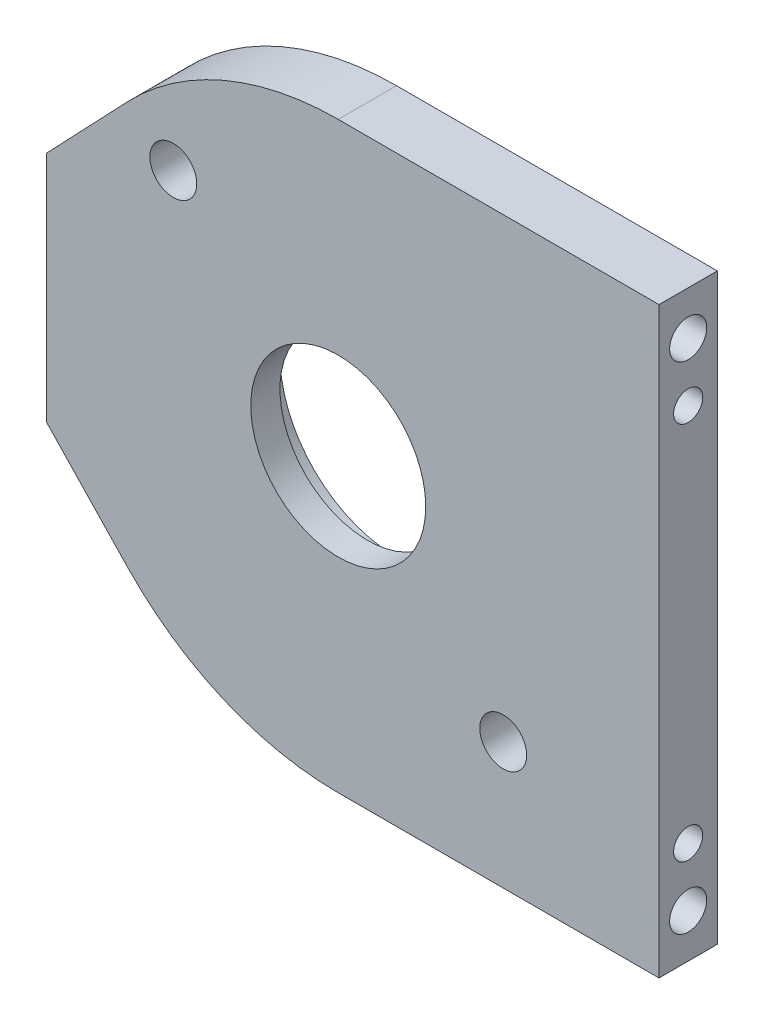
ISO-10303-21;
HEADER;
FILE_DESCRIPTION(('STEP AP214'),'2;1');
FILE_NAME('part.step','',(''),(''),'','','');
FILE_SCHEMA(('AUTOMOTIVE_DESIGN { 1 0 10303 214 1 1 1 1 }'));
ENDSEC;
DATA;
#1=APPLICATION_CONTEXT('core data for automotive mechanical design processes');
#2=APPLICATION_PROTOCOL_DEFINITION('international standard','automotive_design',2000,#1);
#3=PRODUCT_CONTEXT('',#1,'mechanical');
#4=PRODUCT('Part','Part','',(#3));
#5=PRODUCT_RELATED_PRODUCT_CATEGORY('part','',(#4));
#6=PRODUCT_DEFINITION_FORMATION('','',#4);
#7=PRODUCT_DEFINITION_CONTEXT('part definition',#1,'design');
#8=PRODUCT_DEFINITION('design','',#6,#7);
#9=PRODUCT_DEFINITION_SHAPE('','',#8);
#10=(LENGTH_UNIT() NAMED_UNIT(*) SI_UNIT(.MILLI.,.METRE.));
#11=(NAMED_UNIT(*) PLANE_ANGLE_UNIT() SI_UNIT($,.RADIAN.));
#12=(NAMED_UNIT(*) SI_UNIT($,.STERADIAN.) SOLID_ANGLE_UNIT());
#13=UNCERTAINTY_MEASURE_WITH_UNIT(LENGTH_MEASURE(1.E-05),#10,'distance_accuracy_value','');
#14=(GEOMETRIC_REPRESENTATION_CONTEXT(3) GLOBAL_UNCERTAINTY_ASSIGNED_CONTEXT((#13)) GLOBAL_UNIT_ASSIGNED_CONTEXT((#10,
#11,#12)) REPRESENTATION_CONTEXT('',''));
#15=CARTESIAN_POINT('',(0.,0.,0.));
#16=DIRECTION('',(0.,0.,1.));
#17=DIRECTION('',(1.,0.,0.));
#18=AXIS2_PLACEMENT_3D('',#15,#16,#17);
#19=CARTESIAN_POINT('',(0.,0.,6.35));
#20=DIRECTION('',(0.,0.,1.));
#21=DIRECTION('',(1.,0.,0.));
#22=AXIS2_PLACEMENT_3D('',#19,#20,#21);
#23=PLANE('',#22);
#24=CARTESIAN_POINT('',(-17.9605122421383,17.9605122421383,6.35));
#25=DIRECTION('',(0.,0.,1.));
#26=DIRECTION('',(1.,0.,0.));
#27=AXIS2_PLACEMENT_3D('',#24,#25,#26);
#28=CIRCLE('',#27,2.55269999999999);
#29=CARTESIAN_POINT('',(-15.4078122421383,17.9605122421383,6.35));
#30=VERTEX_POINT('',#29);
#31=EDGE_CURVE('E198',#30,#30,#28,.T.);
#32=ORIENTED_EDGE('',*,*,#31,.F.);
#33=EDGE_LOOP('',(#32));
#34=FACE_BOUND('',#33,.T.);
#35=CARTESIAN_POINT('',(17.9605122421383,-17.9605122421383,6.35));
#36=DIRECTION('',(0.,0.,1.));
#37=DIRECTION('',(1.,0.,0.));
#38=AXIS2_PLACEMENT_3D('',#35,#36,#37);
#39=CIRCLE('',#38,2.55269999999999);
#40=CARTESIAN_POINT('',(20.5132122421383,-17.9605122421383,6.35));
#41=VERTEX_POINT('',#40);
#42=EDGE_CURVE('E192',#41,#41,#39,.T.);
#43=ORIENTED_EDGE('',*,*,#42,.F.);
#44=EDGE_LOOP('',(#43));
#45=FACE_BOUND('',#44,.T.);
#46=CARTESIAN_POINT('',(0.,0.,6.35));
#47=DIRECTION('',(0.,0.,1.));
#48=DIRECTION('',(1.,0.,0.));
#49=AXIS2_PLACEMENT_3D('',#46,#47,#48);
#50=CIRCLE('',#49,31.75);
#51=CARTESIAN_POINT('',(0.,31.75,6.35));
#52=VERTEX_POINT('',#51);
#53=CARTESIAN_POINT('',(-22.9913793103448,21.8965517241379,6.35));
#54=VERTEX_POINT('',#53);
#55=EDGE_CURVE('E153',#52,#54,#50,.T.);
#56=ORIENTED_EDGE('',*,*,#55,.T.);
#57=DIRECTION('',(-0.689655172413793,-0.724137931034483,0.));
#58=VECTOR('',#57,1.);
#59=CARTESIAN_POINT('',(-22.9913793103448,21.8965517241379,6.35));
#60=LINE('',#59,#58);
#61=CARTESIAN_POINT('',(-31.75,12.7,6.35));
#62=VERTEX_POINT('',#61);
#63=EDGE_CURVE('E99',#54,#62,#60,.T.);
#64=ORIENTED_EDGE('',*,*,#63,.T.);
#65=DIRECTION('',(0.,-1.,0.));
#66=VECTOR('',#65,1.);
#67=CARTESIAN_POINT('',(-31.75,12.7,6.35));
#68=LINE('',#67,#66);
#69=CARTESIAN_POINT('',(-31.75,-12.7,6.35));
#70=VERTEX_POINT('',#69);
#71=EDGE_CURVE('E169',#62,#70,#68,.T.);
#72=ORIENTED_EDGE('',*,*,#71,.T.);
#73=DIRECTION('',(0.689655172413794,-0.724137931034482,0.));
#74=VECTOR('',#73,1.);
#75=CARTESIAN_POINT('',(-22.9913793103448,-21.8965517241379,6.35));
#76=LINE('',#75,#74);
#77=CARTESIAN_POINT('',(-22.9913793103448,-21.8965517241379,6.35));
#78=VERTEX_POINT('',#77);
#79=EDGE_CURVE('E181',#70,#78,#76,.T.);
#80=ORIENTED_EDGE('',*,*,#79,.T.);
#81=CARTESIAN_POINT('',(0.,0.,6.35));
#82=DIRECTION('',(0.,0.,1.));
#83=DIRECTION('',(1.,0.,0.));
#84=AXIS2_PLACEMENT_3D('',#81,#82,#83);
#85=CIRCLE('',#84,31.75);
#86=CARTESIAN_POINT('',(0.,-31.75,6.35));
#87=VERTEX_POINT('',#86);
#88=EDGE_CURVE('E120',#78,#87,#85,.T.);
#89=ORIENTED_EDGE('',*,*,#88,.T.);
#90=DIRECTION('',(1.,0.,0.));
#91=VECTOR('',#90,1.);
#92=CARTESIAN_POINT('',(34.925,-31.75,6.35));
#93=LINE('',#92,#91);
#94=CARTESIAN_POINT('',(34.925,-31.75,6.35));
#95=VERTEX_POINT('',#94);
#96=EDGE_CURVE('E114',#87,#95,#93,.T.);
#97=ORIENTED_EDGE('',*,*,#96,.T.);
#98=DIRECTION('',(0.,1.,0.));
#99=VECTOR('',#98,1.);
#100=CARTESIAN_POINT('',(34.925,31.75,6.35));
#101=LINE('',#100,#99);
#102=CARTESIAN_POINT('',(34.925,31.75,6.35));
#103=VERTEX_POINT('',#102);
#104=EDGE_CURVE('E118',#95,#103,#101,.T.);
#105=ORIENTED_EDGE('',*,*,#104,.T.);
#106=DIRECTION('',(-1.,0.,0.));
#107=VECTOR('',#106,1.);
#108=CARTESIAN_POINT('',(34.925,31.75,6.35));
#109=LINE('',#108,#107);
#110=EDGE_CURVE('E55',#103,#52,#109,.T.);
#111=ORIENTED_EDGE('',*,*,#110,.T.);
#112=EDGE_LOOP('',(#56,#64,#72,#80,#89,#97,#105,#111));
#113=FACE_BOUND('',#112,.T.);
#114=CARTESIAN_POINT('',(0.,0.,6.35));
#115=DIRECTION('',(0.,0.,1.));
#116=DIRECTION('',(1.,0.,0.));
#117=AXIS2_PLACEMENT_3D('',#114,#115,#116);
#118=CIRCLE('',#117,9.525);
#119=CARTESIAN_POINT('',(9.525,0.,6.35));
#120=VERTEX_POINT('',#119);
#121=EDGE_CURVE('E142',#120,#120,#118,.T.);
#122=ORIENTED_EDGE('',*,*,#121,.F.);
#123=EDGE_LOOP('',(#122));
#124=FACE_BOUND('',#123,.T.);
#125=ADVANCED_FACE('F37',(#34,#45,#113,#124),#23,.T.);
#126=CARTESIAN_POINT('',(0.,0.,0.));
#127=DIRECTION('',(0.,0.,1.));
#128=DIRECTION('',(1.,0.,0.));
#129=AXIS2_PLACEMENT_3D('',#126,#127,#128);
#130=PLANE('',#129);
#131=CARTESIAN_POINT('',(0.,0.,0.));
#132=DIRECTION('',(0.,0.,1.));
#133=DIRECTION('',(1.,0.,0.));
#134=AXIS2_PLACEMENT_3D('',#131,#132,#133);
#135=CIRCLE('',#134,12.7);
#136=CARTESIAN_POINT('',(12.7,0.,0.));
#137=VERTEX_POINT('',#136);
#138=EDGE_CURVE('E213',#137,#137,#135,.T.);
#139=ORIENTED_EDGE('',*,*,#138,.T.);
#140=EDGE_LOOP('',(#139));
#141=FACE_BOUND('',#140,.T.);
#142=CARTESIAN_POINT('',(-17.9605122421383,17.9605122421383,0.));
#143=DIRECTION('',(0.,0.,1.));
#144=DIRECTION('',(1.,0.,0.));
#145=AXIS2_PLACEMENT_3D('',#142,#143,#144);
#146=CIRCLE('',#145,2.5527);
#147=CARTESIAN_POINT('',(-15.4078122421383,17.9605122421383,0.));
#148=VERTEX_POINT('',#147);
#149=EDGE_CURVE('E195',#148,#148,#146,.T.);
#150=ORIENTED_EDGE('',*,*,#149,.T.);
#151=EDGE_LOOP('',(#150));
#152=FACE_BOUND('',#151,.T.);
#153=CARTESIAN_POINT('',(17.9605122421383,-17.9605122421383,0.));
#154=DIRECTION('',(0.,0.,1.));
#155=DIRECTION('',(1.,0.,0.));
#156=AXIS2_PLACEMENT_3D('',#153,#154,#155);
#157=CIRCLE('',#156,2.5527);
#158=CARTESIAN_POINT('',(20.5132122421383,-17.9605122421383,0.));
#159=VERTEX_POINT('',#158);
#160=EDGE_CURVE('E189',#159,#159,#157,.T.);
#161=ORIENTED_EDGE('',*,*,#160,.T.);
#162=EDGE_LOOP('',(#161));
#163=FACE_BOUND('',#162,.T.);
#164=CARTESIAN_POINT('',(0.,0.,0.));
#165=DIRECTION('',(0.,0.,1.));
#166=DIRECTION('',(1.,0.,0.));
#167=AXIS2_PLACEMENT_3D('',#164,#165,#166);
#168=CIRCLE('',#167,31.75);
#169=CARTESIAN_POINT('',(0.,31.75,0.));
#170=VERTEX_POINT('',#169);
#171=CARTESIAN_POINT('',(-22.9913793103448,21.8965517241379,0.));
#172=VERTEX_POINT('',#171);
#173=EDGE_CURVE('E138',#170,#172,#168,.T.);
#174=ORIENTED_EDGE('',*,*,#173,.F.);
#175=DIRECTION('',(-1.,0.,0.));
#176=VECTOR('',#175,1.);
#177=CARTESIAN_POINT('',(34.925,31.75,0.));
#178=LINE('',#177,#176);
#179=CARTESIAN_POINT('',(34.925,31.75,0.));
#180=VERTEX_POINT('',#179);
#181=EDGE_CURVE('E91',#180,#170,#178,.T.);
#182=ORIENTED_EDGE('',*,*,#181,.F.);
#183=DIRECTION('',(0.,1.,0.));
#184=VECTOR('',#183,1.);
#185=CARTESIAN_POINT('',(34.925,31.75,0.));
#186=LINE('',#185,#184);
#187=CARTESIAN_POINT('',(34.925,-31.75,0.));
#188=VERTEX_POINT('',#187);
#189=EDGE_CURVE('E85',#188,#180,#186,.T.);
#190=ORIENTED_EDGE('',*,*,#189,.F.);
#191=DIRECTION('',(1.,0.,0.));
#192=VECTOR('',#191,1.);
#193=CARTESIAN_POINT('',(34.925,-31.75,0.));
#194=LINE('',#193,#192);
#195=CARTESIAN_POINT('',(0.,-31.75,0.));
#196=VERTEX_POINT('',#195);
#197=EDGE_CURVE('E128',#196,#188,#194,.T.);
#198=ORIENTED_EDGE('',*,*,#197,.F.);
#199=CARTESIAN_POINT('',(0.,0.,0.));
#200=DIRECTION('',(0.,0.,1.));
#201=DIRECTION('',(1.,0.,0.));
#202=AXIS2_PLACEMENT_3D('',#199,#200,#201);
#203=CIRCLE('',#202,31.75);
#204=CARTESIAN_POINT('',(-22.9913793103448,-21.8965517241379,0.));
#205=VERTEX_POINT('',#204);
#206=EDGE_CURVE('E148',#205,#196,#203,.T.);
#207=ORIENTED_EDGE('',*,*,#206,.F.);
#208=DIRECTION('',(0.689655172413794,-0.724137931034482,0.));
#209=VECTOR('',#208,1.);
#210=CARTESIAN_POINT('',(-22.9913793103448,-21.8965517241379,0.));
#211=LINE('',#210,#209);
#212=CARTESIAN_POINT('',(-31.75,-12.7,0.));
#213=VERTEX_POINT('',#212);
#214=EDGE_CURVE('E146',#213,#205,#211,.T.);
#215=ORIENTED_EDGE('',*,*,#214,.F.);
#216=DIRECTION('',(0.,-1.,0.));
#217=VECTOR('',#216,1.);
#218=CARTESIAN_POINT('',(-31.75,12.7,0.));
#219=LINE('',#218,#217);
#220=CARTESIAN_POINT('',(-31.75,12.7,0.));
#221=VERTEX_POINT('',#220);
#222=EDGE_CURVE('E144',#221,#213,#219,.T.);
#223=ORIENTED_EDGE('',*,*,#222,.F.);
#224=DIRECTION('',(-0.689655172413793,-0.724137931034483,0.));
#225=VECTOR('',#224,1.);
#226=CARTESIAN_POINT('',(-22.9913793103448,21.8965517241379,0.));
#227=LINE('',#226,#225);
#228=EDGE_CURVE('E141',#172,#221,#227,.T.);
#229=ORIENTED_EDGE('',*,*,#228,.F.);
#230=EDGE_LOOP('',(#174,#182,#190,#198,#207,#215,#223,#229));
#231=FACE_BOUND('',#230,.T.);
#232=ADVANCED_FACE('F173',(#141,#152,#163,#231),#130,.F.);
#233=CARTESIAN_POINT('',(0.,0.,6.35));
#234=DIRECTION('',(0.,0.,-1.));
#235=DIRECTION('',(-1.,0.,0.));
#236=AXIS2_PLACEMENT_3D('',#233,#234,#235);
#237=CYLINDRICAL_SURFACE('',#236,31.75);
#238=ORIENTED_EDGE('',*,*,#173,.T.);
#239=DIRECTION('',(0.,0.,-1.));
#240=VECTOR('',#239,1.);
#241=CARTESIAN_POINT('',(-22.9913793103448,21.8965517241379,6.35));
#242=LINE('',#241,#240);
#243=EDGE_CURVE('E11',#54,#172,#242,.T.);
#244=ORIENTED_EDGE('',*,*,#243,.F.);
#245=ORIENTED_EDGE('',*,*,#55,.F.);
#246=DIRECTION('',(0.,0.,-1.));
#247=VECTOR('',#246,1.);
#248=CARTESIAN_POINT('',(0.,31.75,6.35));
#249=LINE('',#248,#247);
#250=EDGE_CURVE('E134',#52,#170,#249,.T.);
#251=ORIENTED_EDGE('',*,*,#250,.T.);
#252=EDGE_LOOP('',(#238,#244,#245,#251));
#253=FACE_BOUND('',#252,.T.);
#254=ADVANCED_FACE('F39',(#253),#237,.T.);
#255=CARTESIAN_POINT('',(-22.9913793103448,21.8965517241379,6.35));
#256=DIRECTION('',(0.724137931034483,-0.689655172413793,0.));
#257=DIRECTION('',(0.689655172413793,0.724137931034483,0.));
#258=AXIS2_PLACEMENT_3D('',#255,#256,#257);
#259=PLANE('',#258);
#260=ORIENTED_EDGE('',*,*,#228,.T.);
#261=DIRECTION('',(0.,0.,-1.));
#262=VECTOR('',#261,1.);
#263=CARTESIAN_POINT('',(-31.75,12.7,6.35));
#264=LINE('',#263,#262);
#265=EDGE_CURVE('E47',#62,#221,#264,.T.);
#266=ORIENTED_EDGE('',*,*,#265,.F.);
#267=ORIENTED_EDGE('',*,*,#63,.F.);
#268=ORIENTED_EDGE('',*,*,#243,.T.);
#269=EDGE_LOOP('',(#260,#266,#267,#268));
#270=FACE_BOUND('',#269,.T.);
#271=ADVANCED_FACE('F254',(#270),#259,.F.);
#272=CARTESIAN_POINT('',(-31.75,12.7,6.35));
#273=DIRECTION('',(1.,0.,0.));
#274=DIRECTION('',(0.,1.,0.));
#275=AXIS2_PLACEMENT_3D('',#272,#273,#274);
#276=PLANE('',#275);
#277=CARTESIAN_POINT('',(-31.75,0.,3.175));
#278=DIRECTION('',(-1.,0.,0.));
#279=DIRECTION('',(0.,0.,1.));
#280=AXIS2_PLACEMENT_3D('',#277,#278,#279);
#281=CIRCLE('',#280,2.0193);
#282=CARTESIAN_POINT('',(-31.75,0.,5.1943));
#283=VERTEX_POINT('',#282);
#284=EDGE_CURVE('E246',#283,#283,#281,.T.);
#285=ORIENTED_EDGE('',*,*,#284,.F.);
#286=EDGE_LOOP('',(#285));
#287=FACE_BOUND('',#286,.T.);
#288=CARTESIAN_POINT('',(-31.75,7.93750000000001,3.175));
#289=DIRECTION('',(-1.,0.,0.));
#290=DIRECTION('',(0.,0.,1.));
#291=AXIS2_PLACEMENT_3D('',#288,#289,#290);
#292=CIRCLE('',#291,1.58749999999999);
#293=CARTESIAN_POINT('',(-31.75,7.93750000000001,4.76249999999999));
#294=VERTEX_POINT('',#293);
#295=EDGE_CURVE('E240',#294,#294,#292,.T.);
#296=ORIENTED_EDGE('',*,*,#295,.F.);
#297=EDGE_LOOP('',(#296));
#298=FACE_BOUND('',#297,.T.);
#299=CARTESIAN_POINT('',(-31.75,-7.93749999999999,3.175));
#300=DIRECTION('',(-1.,0.,0.));
#301=DIRECTION('',(0.,0.,1.));
#302=AXIS2_PLACEMENT_3D('',#299,#300,#301);
#303=CIRCLE('',#302,1.58749999999999);
#304=CARTESIAN_POINT('',(-31.75,-7.93749999999999,4.76249999999999));
#305=VERTEX_POINT('',#304);
#306=EDGE_CURVE('E234',#305,#305,#303,.T.);
#307=ORIENTED_EDGE('',*,*,#306,.F.);
#308=EDGE_LOOP('',(#307));
#309=FACE_BOUND('',#308,.T.);
#310=ORIENTED_EDGE('',*,*,#222,.T.);
#311=DIRECTION('',(0.,0.,-1.));
#312=VECTOR('',#311,1.);
#313=CARTESIAN_POINT('',(-31.75,-12.7,6.35));
#314=LINE('',#313,#312);
#315=EDGE_CURVE('E160',#70,#213,#314,.T.);
#316=ORIENTED_EDGE('',*,*,#315,.F.);
#317=ORIENTED_EDGE('',*,*,#71,.F.);
#318=ORIENTED_EDGE('',*,*,#265,.T.);
#319=EDGE_LOOP('',(#310,#316,#317,#318));
#320=FACE_BOUND('',#319,.T.);
#321=ADVANCED_FACE('F167',(#287,#298,#309,#320),#276,.F.);
#322=CARTESIAN_POINT('',(-22.9913793103448,-21.8965517241379,6.35));
#323=DIRECTION('',(0.724137931034482,0.689655172413794,0.));
#324=DIRECTION('',(-0.689655172413794,0.724137931034482,0.));
#325=AXIS2_PLACEMENT_3D('',#322,#323,#324);
#326=PLANE('',#325);
#327=ORIENTED_EDGE('',*,*,#214,.T.);
#328=DIRECTION('',(0.,0.,-1.));
#329=VECTOR('',#328,1.);
#330=CARTESIAN_POINT('',(-22.9913793103448,-21.8965517241379,6.35));
#331=LINE('',#330,#329);
#332=EDGE_CURVE('E157',#78,#205,#331,.T.);
#333=ORIENTED_EDGE('',*,*,#332,.F.);
#334=ORIENTED_EDGE('',*,*,#79,.F.);
#335=ORIENTED_EDGE('',*,*,#315,.T.);
#336=EDGE_LOOP('',(#327,#333,#334,#335));
#337=FACE_BOUND('',#336,.T.);
#338=ADVANCED_FACE('F177',(#337),#326,.F.);
#339=CARTESIAN_POINT('',(0.,0.,6.35));
#340=DIRECTION('',(0.,0.,-1.));
#341=DIRECTION('',(-1.,0.,0.));
#342=AXIS2_PLACEMENT_3D('',#339,#340,#341);
#343=CYLINDRICAL_SURFACE('',#342,31.75);
#344=ORIENTED_EDGE('',*,*,#206,.T.);
#345=DIRECTION('',(0.,0.,-1.));
#346=VECTOR('',#345,1.);
#347=CARTESIAN_POINT('',(0.,-31.75,6.35));
#348=LINE('',#347,#346);
#349=EDGE_CURVE('E129',#87,#196,#348,.T.);
#350=ORIENTED_EDGE('',*,*,#349,.F.);
#351=ORIENTED_EDGE('',*,*,#88,.F.);
#352=ORIENTED_EDGE('',*,*,#332,.T.);
#353=EDGE_LOOP('',(#344,#350,#351,#352));
#354=FACE_BOUND('',#353,.T.);
#355=ADVANCED_FACE('F180',(#354),#343,.T.);
#356=CARTESIAN_POINT('',(34.925,-31.75,6.35));
#357=DIRECTION('',(0.,1.,0.));
#358=DIRECTION('',(-1.,0.,0.));
#359=AXIS2_PLACEMENT_3D('',#356,#357,#358);
#360=PLANE('',#359);
#361=ORIENTED_EDGE('',*,*,#197,.T.);
#362=DIRECTION('',(0.,0.,-1.));
#363=VECTOR('',#362,1.);
#364=CARTESIAN_POINT('',(34.925,-31.75,6.35));
#365=LINE('',#364,#363);
#366=EDGE_CURVE('E125',#95,#188,#365,.T.);
#367=ORIENTED_EDGE('',*,*,#366,.F.);
#368=ORIENTED_EDGE('',*,*,#96,.F.);
#369=ORIENTED_EDGE('',*,*,#349,.T.);
#370=EDGE_LOOP('',(#361,#367,#368,#369));
#371=FACE_BOUND('',#370,.T.);
#372=ADVANCED_FACE('F126',(#371),#360,.F.);
#373=CARTESIAN_POINT('',(34.925,31.75,6.35));
#374=DIRECTION('',(-1.,0.,0.));
#375=DIRECTION('',(0.,-1.,0.));
#376=AXIS2_PLACEMENT_3D('',#373,#374,#375);
#377=PLANE('',#376);
#378=CARTESIAN_POINT('',(34.925,26.9875,3.175));
#379=DIRECTION('',(1.,0.,0.));
#380=DIRECTION('',(0.,0.,-1.));
#381=AXIS2_PLACEMENT_3D('',#378,#379,#380);
#382=CIRCLE('',#381,2.0193);
#383=CARTESIAN_POINT('',(34.925,26.9875,1.1557));
#384=VERTEX_POINT('',#383);
#385=EDGE_CURVE('E228',#384,#384,#382,.T.);
#386=ORIENTED_EDGE('',*,*,#385,.F.);
#387=EDGE_LOOP('',(#386));
#388=FACE_BOUND('',#387,.T.);
#389=CARTESIAN_POINT('',(34.925,-26.9875,3.175));
#390=DIRECTION('',(1.,0.,0.));
#391=DIRECTION('',(0.,0.,-1.));
#392=AXIS2_PLACEMENT_3D('',#389,#390,#391);
#393=CIRCLE('',#392,2.0193);
#394=CARTESIAN_POINT('',(34.925,-26.9875,1.1557));
#395=VERTEX_POINT('',#394);
#396=EDGE_CURVE('E222',#395,#395,#393,.T.);
#397=ORIENTED_EDGE('',*,*,#396,.F.);
#398=EDGE_LOOP('',(#397));
#399=FACE_BOUND('',#398,.T.);
#400=CARTESIAN_POINT('',(34.925,20.6375,3.175));
#401=DIRECTION('',(1.,0.,0.));
#402=DIRECTION('',(0.,0.,-1.));
#403=AXIS2_PLACEMENT_3D('',#400,#401,#402);
#404=CIRCLE('',#403,1.58749999999999);
#405=CARTESIAN_POINT('',(34.925,20.6375,1.58750000000001));
#406=VERTEX_POINT('',#405);
#407=EDGE_CURVE('E210',#406,#406,#404,.T.);
#408=ORIENTED_EDGE('',*,*,#407,.F.);
#409=EDGE_LOOP('',(#408));
#410=FACE_BOUND('',#409,.T.);
#411=CARTESIAN_POINT('',(34.925,-20.6375,3.175));
#412=DIRECTION('',(1.,0.,0.));
#413=DIRECTION('',(0.,0.,-1.));
#414=AXIS2_PLACEMENT_3D('',#411,#412,#413);
#415=CIRCLE('',#414,1.58749999999999);
#416=CARTESIAN_POINT('',(34.925,-20.6375,1.58750000000001));
#417=VERTEX_POINT('',#416);
#418=EDGE_CURVE('E204',#417,#417,#415,.T.);
#419=ORIENTED_EDGE('',*,*,#418,.F.);
#420=EDGE_LOOP('',(#419));
#421=FACE_BOUND('',#420,.T.);
#422=ORIENTED_EDGE('',*,*,#189,.T.);
#423=DIRECTION('',(0.,0.,-1.));
#424=VECTOR('',#423,1.);
#425=CARTESIAN_POINT('',(34.925,31.75,6.35));
#426=LINE('',#425,#424);
#427=EDGE_CURVE('E130',#103,#180,#426,.T.);
#428=ORIENTED_EDGE('',*,*,#427,.F.);
#429=ORIENTED_EDGE('',*,*,#104,.F.);
#430=ORIENTED_EDGE('',*,*,#366,.T.);
#431=EDGE_LOOP('',(#422,#428,#429,#430));
#432=FACE_BOUND('',#431,.T.);
#433=ADVANCED_FACE('F132',(#388,#399,#410,#421,#432),#377,.F.);
#434=CARTESIAN_POINT('',(34.925,31.75,6.35));
#435=DIRECTION('',(0.,-1.,0.));
#436=DIRECTION('',(0.,0.,-1.));
#437=AXIS2_PLACEMENT_3D('',#434,#435,#436);
#438=PLANE('',#437);
#439=ORIENTED_EDGE('',*,*,#181,.T.);
#440=ORIENTED_EDGE('',*,*,#250,.F.);
#441=ORIENTED_EDGE('',*,*,#110,.F.);
#442=ORIENTED_EDGE('',*,*,#427,.T.);
#443=EDGE_LOOP('',(#439,#440,#441,#442));
#444=FACE_BOUND('',#443,.T.);
#445=ADVANCED_FACE('F291',(#444),#438,.F.);
#446=CARTESIAN_POINT('',(0.,0.,6.35));
#447=DIRECTION('',(0.,0.,-1.));
#448=DIRECTION('',(-1.,0.,0.));
#449=AXIS2_PLACEMENT_3D('',#446,#447,#448);
#450=CYLINDRICAL_SURFACE('',#449,9.525);
#451=CARTESIAN_POINT('',(0.,0.,3.175));
#452=DIRECTION('',(0.,0.,1.));
#453=DIRECTION('',(1.,0.,0.));
#454=AXIS2_PLACEMENT_3D('',#451,#452,#453);
#455=CIRCLE('',#454,9.525);
#456=CARTESIAN_POINT('',(9.525,0.,3.175));
#457=VERTEX_POINT('',#456);
#458=EDGE_CURVE('E41',#457,#457,#455,.T.);
#459=ORIENTED_EDGE('',*,*,#458,.F.);
#460=EDGE_LOOP('',(#459));
#461=FACE_BOUND('',#460,.T.);
#462=ORIENTED_EDGE('',*,*,#121,.T.);
#463=EDGE_LOOP('',(#462));
#464=FACE_BOUND('',#463,.T.);
#465=ADVANCED_FACE('F288',(#461,#464),#450,.F.);
#466=CARTESIAN_POINT('',(17.9605122421383,-17.9605122421383,6.35));
#467=DIRECTION('',(0.,0.,1.));
#468=DIRECTION('',(1.,0.,0.));
#469=AXIS2_PLACEMENT_3D('',#466,#467,#468);
#470=CYLINDRICAL_SURFACE('',#469,2.55269999999999);
#471=ORIENTED_EDGE('',*,*,#160,.F.);
#472=EDGE_LOOP('',(#471));
#473=FACE_BOUND('',#472,.T.);
#474=ORIENTED_EDGE('',*,*,#42,.T.);
#475=EDGE_LOOP('',(#474));
#476=FACE_BOUND('',#475,.T.);
#477=ADVANCED_FACE('F331',(#473,#476),#470,.F.);
#478=CARTESIAN_POINT('',(-17.9605122421383,17.9605122421383,6.35));
#479=DIRECTION('',(0.,0.,1.));
#480=DIRECTION('',(1.,0.,0.));
#481=AXIS2_PLACEMENT_3D('',#478,#479,#480);
#482=CYLINDRICAL_SURFACE('',#481,2.55269999999999);
#483=ORIENTED_EDGE('',*,*,#149,.F.);
#484=EDGE_LOOP('',(#483));
#485=FACE_BOUND('',#484,.T.);
#486=ORIENTED_EDGE('',*,*,#31,.T.);
#487=EDGE_LOOP('',(#486));
#488=FACE_BOUND('',#487,.T.);
#489=ADVANCED_FACE('F494',(#485,#488),#482,.F.);
#490=CARTESIAN_POINT('',(24.765,-20.6375,3.175));
#491=DIRECTION('',(1.,0.,0.));
#492=DIRECTION('',(0.,0.,-1.));
#493=AXIS2_PLACEMENT_3D('',#490,#491,#492);
#494=CONICAL_SURFACE('',#493,1.5875,1.02974425867665);
#495=CARTESIAN_POINT('',(23.8111337672938,-20.6375,3.175));
#496=VERTEX_POINT('',#495);
#497=VERTEX_LOOP('',#496);
#498=FACE_BOUND('',#497,.T.);
#499=CARTESIAN_POINT('',(24.765,-20.6375,3.175));
#500=DIRECTION('',(1.,0.,0.));
#501=DIRECTION('',(0.,0.,-1.));
#502=AXIS2_PLACEMENT_3D('',#499,#500,#501);
#503=CIRCLE('',#502,1.5875);
#504=CARTESIAN_POINT('',(24.765,-20.6375,1.5875));
#505=VERTEX_POINT('',#504);
#506=EDGE_CURVE('E201',#505,#505,#503,.T.);
#507=ORIENTED_EDGE('',*,*,#506,.T.);
#508=EDGE_LOOP('',(#507));
#509=FACE_BOUND('',#508,.T.);
#510=ADVANCED_FACE('F490',(#498,#509),#494,.F.);
#511=CARTESIAN_POINT('',(34.925,-20.6375,3.175));
#512=DIRECTION('',(1.,0.,0.));
#513=DIRECTION('',(0.,0.,-1.));
#514=AXIS2_PLACEMENT_3D('',#511,#512,#513);
#515=CYLINDRICAL_SURFACE('',#514,1.5875);
#516=ORIENTED_EDGE('',*,*,#506,.F.);
#517=EDGE_LOOP('',(#516));
#518=FACE_BOUND('',#517,.T.);
#519=ORIENTED_EDGE('',*,*,#418,.T.);
#520=EDGE_LOOP('',(#519));
#521=FACE_BOUND('',#520,.T.);
#522=ADVANCED_FACE('F493',(#518,#521),#515,.F.);
#523=CARTESIAN_POINT('',(24.765,20.6375,3.175));
#524=DIRECTION('',(1.,0.,0.));
#525=DIRECTION('',(0.,0.,-1.));
#526=AXIS2_PLACEMENT_3D('',#523,#524,#525);
#527=CONICAL_SURFACE('',#526,1.5875,1.02974425867665);
#528=CARTESIAN_POINT('',(23.8111337672937,20.6375,3.175));
#529=VERTEX_POINT('',#528);
#530=VERTEX_LOOP('',#529);
#531=FACE_BOUND('',#530,.T.);
#532=CARTESIAN_POINT('',(24.765,20.6375,3.175));
#533=DIRECTION('',(1.,0.,0.));
#534=DIRECTION('',(0.,0.,-1.));
#535=AXIS2_PLACEMENT_3D('',#532,#533,#534);
#536=CIRCLE('',#535,1.5875);
#537=CARTESIAN_POINT('',(24.765,20.6375,1.5875));
#538=VERTEX_POINT('',#537);
#539=EDGE_CURVE('E207',#538,#538,#536,.T.);
#540=ORIENTED_EDGE('',*,*,#539,.T.);
#541=EDGE_LOOP('',(#540));
#542=FACE_BOUND('',#541,.T.);
#543=ADVANCED_FACE('F500',(#531,#542),#527,.F.);
#544=CARTESIAN_POINT('',(34.925,20.6375,3.175));
#545=DIRECTION('',(1.,0.,0.));
#546=DIRECTION('',(0.,0.,-1.));
#547=AXIS2_PLACEMENT_3D('',#544,#545,#546);
#548=CYLINDRICAL_SURFACE('',#547,1.58749999999999);
#549=ORIENTED_EDGE('',*,*,#539,.F.);
#550=EDGE_LOOP('',(#549));
#551=FACE_BOUND('',#550,.T.);
#552=ORIENTED_EDGE('',*,*,#407,.T.);
#553=EDGE_LOOP('',(#552));
#554=FACE_BOUND('',#553,.T.);
#555=ADVANCED_FACE('F322',(#551,#554),#548,.F.);
#556=CARTESIAN_POINT('',(0.,0.,3.175));
#557=DIRECTION('',(0.,0.,-1.));
#558=DIRECTION('',(-1.,0.,0.));
#559=AXIS2_PLACEMENT_3D('',#556,#557,#558);
#560=CYLINDRICAL_SURFACE('',#559,12.7);
#561=CARTESIAN_POINT('',(0.,0.,3.175));
#562=DIRECTION('',(0.,0.,1.));
#563=DIRECTION('',(1.,0.,0.));
#564=AXIS2_PLACEMENT_3D('',#561,#562,#563);
#565=CIRCLE('',#564,12.7);
#566=CARTESIAN_POINT('',(12.7,0.,3.175));
#567=VERTEX_POINT('',#566);
#568=EDGE_CURVE('E216',#567,#567,#565,.T.);
#569=ORIENTED_EDGE('',*,*,#568,.T.);
#570=EDGE_LOOP('',(#569));
#571=FACE_BOUND('',#570,.T.);
#572=ORIENTED_EDGE('',*,*,#138,.F.);
#573=EDGE_LOOP('',(#572));
#574=FACE_BOUND('',#573,.T.);
#575=ADVANCED_FACE('F339',(#571,#574),#560,.F.);
#576=CARTESIAN_POINT('',(0.,0.,3.175));
#577=DIRECTION('',(0.,0.,1.));
#578=DIRECTION('',(1.,0.,0.));
#579=AXIS2_PLACEMENT_3D('',#576,#577,#578);
#580=PLANE('',#579);
#581=ORIENTED_EDGE('',*,*,#458,.T.);
#582=EDGE_LOOP('',(#581));
#583=FACE_BOUND('',#582,.T.);
#584=ORIENTED_EDGE('',*,*,#568,.F.);
#585=EDGE_LOOP('',(#584));
#586=FACE_BOUND('',#585,.T.);
#587=ADVANCED_FACE('F344',(#583,#586),#580,.F.);
#588=CARTESIAN_POINT('',(19.177,-26.9875,3.175));
#589=DIRECTION('',(1.,0.,0.));
#590=DIRECTION('',(0.,0.,-1.));
#591=AXIS2_PLACEMENT_3D('',#588,#589,#590);
#592=CONICAL_SURFACE('',#591,2.0193,1.02974425867665);
#593=CARTESIAN_POINT('',(17.9636821519977,-26.9875,3.175));
#594=VERTEX_POINT('',#593);
#595=VERTEX_LOOP('',#594);
#596=FACE_BOUND('',#595,.T.);
#597=CARTESIAN_POINT('',(19.177,-26.9875,3.175));
#598=DIRECTION('',(1.,0.,0.));
#599=DIRECTION('',(0.,0.,-1.));
#600=AXIS2_PLACEMENT_3D('',#597,#598,#599);
#601=CIRCLE('',#600,2.0193);
#602=CARTESIAN_POINT('',(19.177,-26.9875,1.1557));
#603=VERTEX_POINT('',#602);
#604=EDGE_CURVE('E217',#603,#603,#601,.T.);
#605=ORIENTED_EDGE('',*,*,#604,.T.);
#606=EDGE_LOOP('',(#605));
#607=FACE_BOUND('',#606,.T.);
#608=ADVANCED_FACE('F354',(#596,#607),#592,.F.);
#609=CARTESIAN_POINT('',(34.925,-26.9875,3.175));
#610=DIRECTION('',(1.,0.,0.));
#611=DIRECTION('',(0.,0.,-1.));
#612=AXIS2_PLACEMENT_3D('',#609,#610,#611);
#613=CYLINDRICAL_SURFACE('',#612,2.0193);
#614=ORIENTED_EDGE('',*,*,#604,.F.);
#615=EDGE_LOOP('',(#614));
#616=FACE_BOUND('',#615,.T.);
#617=ORIENTED_EDGE('',*,*,#396,.T.);
#618=EDGE_LOOP('',(#617));
#619=FACE_BOUND('',#618,.T.);
#620=ADVANCED_FACE('F371',(#616,#619),#613,.F.);
#621=CARTESIAN_POINT('',(19.177,26.9875,3.175));
#622=DIRECTION('',(1.,0.,0.));
#623=DIRECTION('',(0.,0.,-1.));
#624=AXIS2_PLACEMENT_3D('',#621,#622,#623);
#625=CONICAL_SURFACE('',#624,2.0193,1.02974425867665);
#626=CARTESIAN_POINT('',(17.9636821519976,26.9875,3.175));
#627=VERTEX_POINT('',#626);
#628=VERTEX_LOOP('',#627);
#629=FACE_BOUND('',#628,.T.);
#630=CARTESIAN_POINT('',(19.177,26.9875,3.175));
#631=DIRECTION('',(1.,0.,0.));
#632=DIRECTION('',(0.,0.,-1.));
#633=AXIS2_PLACEMENT_3D('',#630,#631,#632);
#634=CIRCLE('',#633,2.0193);
#635=CARTESIAN_POINT('',(19.177,26.9875,1.1557));
#636=VERTEX_POINT('',#635);
#637=EDGE_CURVE('E225',#636,#636,#634,.T.);
#638=ORIENTED_EDGE('',*,*,#637,.T.);
#639=EDGE_LOOP('',(#638));
#640=FACE_BOUND('',#639,.T.);
#641=ADVANCED_FACE('F382',(#629,#640),#625,.F.);
#642=CARTESIAN_POINT('',(34.925,26.9875,3.175));
#643=DIRECTION('',(1.,0.,0.));
#644=DIRECTION('',(0.,0.,-1.));
#645=AXIS2_PLACEMENT_3D('',#642,#643,#644);
#646=CYLINDRICAL_SURFACE('',#645,2.0193);
#647=ORIENTED_EDGE('',*,*,#637,.F.);
#648=EDGE_LOOP('',(#647));
#649=FACE_BOUND('',#648,.T.);
#650=ORIENTED_EDGE('',*,*,#385,.T.);
#651=EDGE_LOOP('',(#650));
#652=FACE_BOUND('',#651,.T.);
#653=ADVANCED_FACE('F273',(#649,#652),#646,.F.);
#654=CARTESIAN_POINT('',(-25.4,-7.93749999999999,3.175));
#655=DIRECTION('',(-1.,0.,0.));
#656=DIRECTION('',(0.,0.,1.));
#657=AXIS2_PLACEMENT_3D('',#654,#655,#656);
#658=CONICAL_SURFACE('',#657,1.5875,1.02974425867665);
#659=CARTESIAN_POINT('',(-24.4461337672937,-7.9375,3.175));
#660=VERTEX_POINT('',#659);
#661=VERTEX_LOOP('',#660);
#662=FACE_BOUND('',#661,.T.);
#663=CARTESIAN_POINT('',(-25.4,-7.93749999999999,3.175));
#664=DIRECTION('',(-1.,0.,0.));
#665=DIRECTION('',(0.,0.,1.));
#666=AXIS2_PLACEMENT_3D('',#663,#664,#665);
#667=CIRCLE('',#666,1.5875);
#668=CARTESIAN_POINT('',(-25.4,-7.93749999999999,4.7625));
#669=VERTEX_POINT('',#668);
#670=EDGE_CURVE('E231',#669,#669,#667,.T.);
#671=ORIENTED_EDGE('',*,*,#670,.T.);
#672=EDGE_LOOP('',(#671));
#673=FACE_BOUND('',#672,.T.);
#674=ADVANCED_FACE('F263',(#662,#673),#658,.F.);
#675=CARTESIAN_POINT('',(-31.75,-7.93749999999999,3.175));
#676=DIRECTION('',(-1.,0.,0.));
#677=DIRECTION('',(0.,0.,1.));
#678=AXIS2_PLACEMENT_3D('',#675,#676,#677);
#679=CYLINDRICAL_SURFACE('',#678,1.58749999999999);
#680=ORIENTED_EDGE('',*,*,#670,.F.);
#681=EDGE_LOOP('',(#680));
#682=FACE_BOUND('',#681,.T.);
#683=ORIENTED_EDGE('',*,*,#306,.T.);
#684=EDGE_LOOP('',(#683));
#685=FACE_BOUND('',#684,.T.);
#686=ADVANCED_FACE('F260',(#682,#685),#679,.F.);
#687=CARTESIAN_POINT('',(-25.4,7.93750000000001,3.175));
#688=DIRECTION('',(-1.,0.,0.));
#689=DIRECTION('',(0.,0.,1.));
#690=AXIS2_PLACEMENT_3D('',#687,#688,#689);
#691=CONICAL_SURFACE('',#690,1.5875,1.02974425867665);
#692=CARTESIAN_POINT('',(-24.4461337672937,7.9375,3.175));
#693=VERTEX_POINT('',#692);
#694=VERTEX_LOOP('',#693);
#695=FACE_BOUND('',#694,.T.);
#696=CARTESIAN_POINT('',(-25.4,7.93750000000001,3.175));
#697=DIRECTION('',(-1.,0.,0.));
#698=DIRECTION('',(0.,0.,1.));
#699=AXIS2_PLACEMENT_3D('',#696,#697,#698);
#700=CIRCLE('',#699,1.5875);
#701=CARTESIAN_POINT('',(-25.4,7.93750000000001,4.7625));
#702=VERTEX_POINT('',#701);
#703=EDGE_CURVE('E237',#702,#702,#700,.T.);
#704=ORIENTED_EDGE('',*,*,#703,.T.);
#705=EDGE_LOOP('',(#704));
#706=FACE_BOUND('',#705,.T.);
#707=ADVANCED_FACE('F262',(#695,#706),#691,.F.);
#708=CARTESIAN_POINT('',(-31.75,7.93750000000001,3.175));
#709=DIRECTION('',(-1.,0.,0.));
#710=DIRECTION('',(0.,0.,1.));
#711=AXIS2_PLACEMENT_3D('',#708,#709,#710);
#712=CYLINDRICAL_SURFACE('',#711,1.58749999999999);
#713=ORIENTED_EDGE('',*,*,#703,.F.);
#714=EDGE_LOOP('',(#713));
#715=FACE_BOUND('',#714,.T.);
#716=ORIENTED_EDGE('',*,*,#295,.T.);
#717=EDGE_LOOP('',(#716));
#718=FACE_BOUND('',#717,.T.);
#719=ADVANCED_FACE('F270',(#715,#718),#712,.F.);
#720=CARTESIAN_POINT('',(-16.002,0.,3.175));
#721=DIRECTION('',(-1.,0.,0.));
#722=DIRECTION('',(0.,0.,1.));
#723=AXIS2_PLACEMENT_3D('',#720,#721,#722);
#724=CONICAL_SURFACE('',#723,2.0193,1.02974425867665);
#725=CARTESIAN_POINT('',(-14.7886821519977,0.,3.175));
#726=VERTEX_POINT('',#725);
#727=VERTEX_LOOP('',#726);
#728=FACE_BOUND('',#727,.T.);
#729=CARTESIAN_POINT('',(-16.002,0.,3.175));
#730=DIRECTION('',(-1.,0.,0.));
#731=DIRECTION('',(0.,0.,1.));
#732=AXIS2_PLACEMENT_3D('',#729,#730,#731);
#733=CIRCLE('',#732,2.0193);
#734=CARTESIAN_POINT('',(-16.002,0.,5.19429999999999));
#735=VERTEX_POINT('',#734);
#736=EDGE_CURVE('E243',#735,#735,#733,.T.);
#737=ORIENTED_EDGE('',*,*,#736,.T.);
#738=EDGE_LOOP('',(#737));
#739=FACE_BOUND('',#738,.T.);
#740=ADVANCED_FACE('F430',(#728,#739),#724,.F.);
#741=CARTESIAN_POINT('',(-31.75,0.,3.175));
#742=DIRECTION('',(-1.,0.,0.));
#743=DIRECTION('',(0.,0.,1.));
#744=AXIS2_PLACEMENT_3D('',#741,#742,#743);
#745=CYLINDRICAL_SURFACE('',#744,2.0193);
#746=ORIENTED_EDGE('',*,*,#736,.F.);
#747=EDGE_LOOP('',(#746));
#748=FACE_BOUND('',#747,.T.);
#749=ORIENTED_EDGE('',*,*,#284,.T.);
#750=EDGE_LOOP('',(#749));
#751=FACE_BOUND('',#750,.T.);
#752=ADVANCED_FACE('F250',(#748,#751),#745,.F.);
#753=CLOSED_SHELL('',(#125,#232,#254,#271,#321,#338,#355,#372,#433,#445,#465,#477,#489,#510,
#522,#543,#555,#575,#587,#608,#620,#641,#653,#674,#686,#707,#719,#740,#752));
#754=MANIFOLD_SOLID_BREP('B2',#753);
#755=ADVANCED_BREP_SHAPE_REPRESENTATION('',(#18,#754),#14);
#756=SHAPE_DEFINITION_REPRESENTATION(#9,#755);
ENDSEC;
END-ISO-10303-21;
